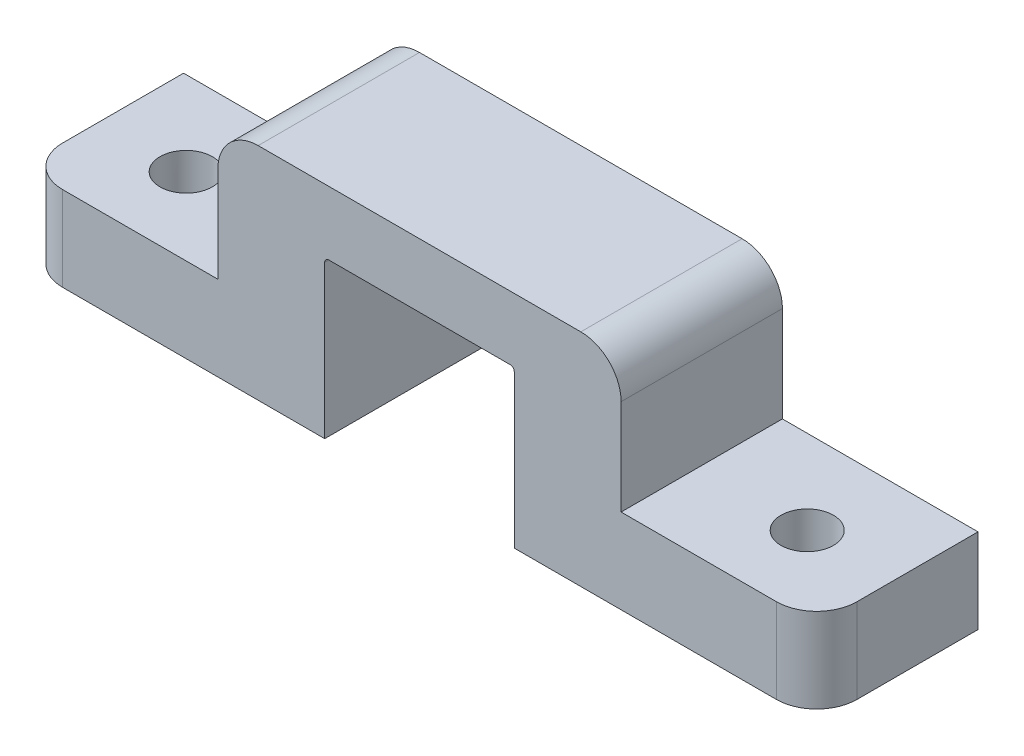
ISO-10303-21;
HEADER;
FILE_DESCRIPTION(('STEP AP214'),'2;1');
FILE_NAME('part.step','',(''),(''),'','','');
FILE_SCHEMA(('AUTOMOTIVE_DESIGN { 1 0 10303 214 1 1 1 1 }'));
ENDSEC;
DATA;
#1=APPLICATION_CONTEXT('core data for automotive mechanical design processes');
#2=APPLICATION_PROTOCOL_DEFINITION('international standard','automotive_design',2000,#1);
#3=PRODUCT_CONTEXT('',#1,'mechanical');
#4=PRODUCT('Part','Part','',(#3));
#5=PRODUCT_RELATED_PRODUCT_CATEGORY('part','',(#4));
#6=PRODUCT_DEFINITION_FORMATION('','',#4);
#7=PRODUCT_DEFINITION_CONTEXT('part definition',#1,'design');
#8=PRODUCT_DEFINITION('design','',#6,#7);
#9=PRODUCT_DEFINITION_SHAPE('','',#8);
#10=(LENGTH_UNIT() NAMED_UNIT(*) SI_UNIT(.MILLI.,.METRE.));
#11=(NAMED_UNIT(*) PLANE_ANGLE_UNIT() SI_UNIT($,.RADIAN.));
#12=(NAMED_UNIT(*) SI_UNIT($,.STERADIAN.) SOLID_ANGLE_UNIT());
#13=UNCERTAINTY_MEASURE_WITH_UNIT(LENGTH_MEASURE(1.E-05),#10,'distance_accuracy_value','');
#14=(GEOMETRIC_REPRESENTATION_CONTEXT(3) GLOBAL_UNCERTAINTY_ASSIGNED_CONTEXT((#13)) GLOBAL_UNIT_ASSIGNED_CONTEXT((#10,
#11,#12)) REPRESENTATION_CONTEXT('',''));
#15=CARTESIAN_POINT('',(0.,0.,0.));
#16=DIRECTION('',(0.,0.,1.));
#17=DIRECTION('',(1.,0.,0.));
#18=AXIS2_PLACEMENT_3D('',#15,#16,#17);
#19=CARTESIAN_POINT('',(25.019,0.,10.16));
#20=DIRECTION('',(0.,1.,0.));
#21=DIRECTION('',(0.,0.,1.));
#22=AXIS2_PLACEMENT_3D('',#19,#20,#21);
#23=PLANE('',#22);
#24=CARTESIAN_POINT('',(19.558,0.,5.29621979529793));
#25=DIRECTION('',(0.,1.,0.));
#26=DIRECTION('',(0.,0.,-1.));
#27=AXIS2_PLACEMENT_3D('',#24,#25,#26);
#28=CIRCLE('',#27,1.651);
#29=CARTESIAN_POINT('',(19.558,0.,3.64521979529793));
#30=VERTEX_POINT('',#29);
#31=EDGE_CURVE('E555',#30,#30,#28,.T.);
#32=ORIENTED_EDGE('',*,*,#31,.T.);
#33=EDGE_LOOP('',(#32));
#34=FACE_BOUND('',#33,.T.);
#35=DIRECTION('',(0.,0.,-1.));
#36=VECTOR('',#35,1.);
#37=CARTESIAN_POINT('',(25.019,0.,10.16));
#38=LINE('',#37,#36);
#39=CARTESIAN_POINT('',(25.019,0.,7.62));
#40=VERTEX_POINT('',#39);
#41=CARTESIAN_POINT('',(25.019,0.,0.));
#42=VERTEX_POINT('',#41);
#43=EDGE_CURVE('E246',#40,#42,#38,.T.);
#44=ORIENTED_EDGE('',*,*,#43,.F.);
#45=CARTESIAN_POINT('',(22.479,0.,7.62));
#46=DIRECTION('',(0.,1.,0.));
#47=DIRECTION('',(0.,0.,1.));
#48=AXIS2_PLACEMENT_3D('',#45,#46,#47);
#49=CIRCLE('',#48,2.54);
#50=CARTESIAN_POINT('',(22.479,0.,10.16));
#51=VERTEX_POINT('',#50);
#52=EDGE_CURVE('E260',#40,#51,#49,.F.);
#53=ORIENTED_EDGE('',*,*,#52,.T.);
#54=DIRECTION('',(1.,0.,0.));
#55=VECTOR('',#54,1.);
#56=CARTESIAN_POINT('',(25.019,0.,10.16));
#57=LINE('',#56,#55);
#58=CARTESIAN_POINT('',(5.969,0.,10.16));
#59=VERTEX_POINT('',#58);
#60=EDGE_CURVE('E166',#59,#51,#57,.T.);
#61=ORIENTED_EDGE('',*,*,#60,.F.);
#62=DIRECTION('',(0.,0.,-1.));
#63=VECTOR('',#62,1.);
#64=CARTESIAN_POINT('',(5.969,0.,10.16));
#65=LINE('',#64,#63);
#66=CARTESIAN_POINT('',(5.969,0.,0.));
#67=VERTEX_POINT('',#66);
#68=EDGE_CURVE('E202',#59,#67,#65,.T.);
#69=ORIENTED_EDGE('',*,*,#68,.T.);
#70=DIRECTION('',(1.,0.,0.));
#71=VECTOR('',#70,1.);
#72=CARTESIAN_POINT('',(25.019,0.,0.));
#73=LINE('',#72,#71);
#74=EDGE_CURVE('E203',#67,#42,#73,.T.);
#75=ORIENTED_EDGE('',*,*,#74,.T.);
#76=EDGE_LOOP('',(#44,#53,#61,#69,#75));
#77=FACE_BOUND('',#76,.T.);
#78=ADVANCED_FACE('F32',(#34,#77),#23,.F.);
#79=CARTESIAN_POINT('',(25.019,5.334,10.16));
#80=DIRECTION('',(-1.,0.,0.));
#81=DIRECTION('',(0.,0.,1.));
#82=AXIS2_PLACEMENT_3D('',#79,#80,#81);
#83=PLANE('',#82);
#84=DIRECTION('',(0.,0.,-1.));
#85=VECTOR('',#84,1.);
#86=CARTESIAN_POINT('',(25.019,5.334,10.16));
#87=LINE('',#86,#85);
#88=CARTESIAN_POINT('',(25.019,5.334,7.62));
#89=VERTEX_POINT('',#88);
#90=CARTESIAN_POINT('',(25.019,5.334,0.));
#91=VERTEX_POINT('',#90);
#92=EDGE_CURVE('E176',#89,#91,#87,.T.);
#93=ORIENTED_EDGE('',*,*,#92,.F.);
#94=DIRECTION('',(0.,1.,0.));
#95=VECTOR('',#94,1.);
#96=CARTESIAN_POINT('',(25.019,5.334,7.62));
#97=LINE('',#96,#95);
#98=EDGE_CURVE('E258',#89,#40,#97,.F.);
#99=ORIENTED_EDGE('',*,*,#98,.T.);
#100=ORIENTED_EDGE('',*,*,#43,.T.);
#101=DIRECTION('',(0.,1.,0.));
#102=VECTOR('',#101,1.);
#103=CARTESIAN_POINT('',(25.019,5.334,0.));
#104=LINE('',#103,#102);
#105=EDGE_CURVE('E206',#42,#91,#104,.T.);
#106=ORIENTED_EDGE('',*,*,#105,.T.);
#107=EDGE_LOOP('',(#93,#99,#100,#106));
#108=FACE_BOUND('',#107,.T.);
#109=ADVANCED_FACE('F317',(#108),#83,.F.);
#110=CARTESIAN_POINT('',(12.7,5.334,10.16));
#111=DIRECTION('',(0.,-1.,0.));
#112=DIRECTION('',(1.,0.,0.));
#113=AXIS2_PLACEMENT_3D('',#110,#111,#112);
#114=PLANE('',#113);
#115=CARTESIAN_POINT('',(19.558,5.334,5.29621979529793));
#116=DIRECTION('',(0.,-1.,0.));
#117=DIRECTION('',(1.,0.,0.));
#118=AXIS2_PLACEMENT_3D('',#115,#116,#117);
#119=CIRCLE('',#118,1.651);
#120=CARTESIAN_POINT('',(21.209,5.334,5.29621979529793));
#121=VERTEX_POINT('',#120);
#122=EDGE_CURVE('E207',#121,#121,#119,.F.);
#123=ORIENTED_EDGE('',*,*,#122,.F.);
#124=EDGE_LOOP('',(#123));
#125=FACE_BOUND('',#124,.T.);
#126=DIRECTION('',(-1.,0.,0.));
#127=VECTOR('',#126,1.);
#128=CARTESIAN_POINT('',(12.7,5.334,10.16));
#129=LINE('',#128,#127);
#130=CARTESIAN_POINT('',(22.479,5.334,10.16));
#131=VERTEX_POINT('',#130);
#132=CARTESIAN_POINT('',(12.7,5.334,10.16));
#133=VERTEX_POINT('',#132);
#134=EDGE_CURVE('E156',#131,#133,#129,.T.);
#135=ORIENTED_EDGE('',*,*,#134,.F.);
#136=CARTESIAN_POINT('',(22.479,5.334,7.62));
#137=DIRECTION('',(0.,-1.,0.));
#138=DIRECTION('',(1.,0.,0.));
#139=AXIS2_PLACEMENT_3D('',#136,#137,#138);
#140=CIRCLE('',#139,2.54);
#141=EDGE_CURVE('E256',#131,#89,#140,.F.);
#142=ORIENTED_EDGE('',*,*,#141,.T.);
#143=ORIENTED_EDGE('',*,*,#92,.T.);
#144=DIRECTION('',(-1.,0.,0.));
#145=VECTOR('',#144,1.);
#146=CARTESIAN_POINT('',(12.7,5.334,0.));
#147=LINE('',#146,#145);
#148=CARTESIAN_POINT('',(12.7,5.334,0.));
#149=VERTEX_POINT('',#148);
#150=EDGE_CURVE('E172',#91,#149,#147,.T.);
#151=ORIENTED_EDGE('',*,*,#150,.T.);
#152=DIRECTION('',(0.,0.,-1.));
#153=VECTOR('',#152,1.);
#154=CARTESIAN_POINT('',(12.7,5.334,10.16));
#155=LINE('',#154,#153);
#156=EDGE_CURVE('E169',#133,#149,#155,.T.);
#157=ORIENTED_EDGE('',*,*,#156,.F.);
#158=EDGE_LOOP('',(#135,#142,#143,#151,#157));
#159=FACE_BOUND('',#158,.T.);
#160=ADVANCED_FACE('F170',(#125,#159),#114,.F.);
#161=CARTESIAN_POINT('',(12.7,13.8940170940171,10.16));
#162=DIRECTION('',(-1.,0.,0.));
#163=DIRECTION('',(0.,-1.,0.));
#164=AXIS2_PLACEMENT_3D('',#161,#162,#163);
#165=PLANE('',#164);
#166=DIRECTION('',(0.,1.,0.));
#167=VECTOR('',#166,1.);
#168=CARTESIAN_POINT('',(12.7,13.8940170940171,0.));
#169=LINE('',#168,#167);
#170=CARTESIAN_POINT('',(12.7,11.3540170940171,0.));
#171=VERTEX_POINT('',#170);
#172=EDGE_CURVE('E211',#149,#171,#169,.T.);
#173=ORIENTED_EDGE('',*,*,#172,.T.);
#174=DIRECTION('',(0.,0.,-1.));
#175=VECTOR('',#174,1.);
#176=CARTESIAN_POINT('',(12.7,11.3540170940171,10.16));
#177=LINE('',#176,#175);
#178=CARTESIAN_POINT('',(12.7,11.3540170940171,10.16));
#179=VERTEX_POINT('',#178);
#180=EDGE_CURVE('E181',#171,#179,#177,.F.);
#181=ORIENTED_EDGE('',*,*,#180,.T.);
#182=DIRECTION('',(0.,1.,0.));
#183=VECTOR('',#182,1.);
#184=CARTESIAN_POINT('',(12.7,13.8940170940171,10.16));
#185=LINE('',#184,#183);
#186=EDGE_CURVE('E161',#133,#179,#185,.T.);
#187=ORIENTED_EDGE('',*,*,#186,.F.);
#188=ORIENTED_EDGE('',*,*,#156,.T.);
#189=EDGE_LOOP('',(#173,#181,#187,#188));
#190=FACE_BOUND('',#189,.T.);
#191=ADVANCED_FACE('F179',(#190),#165,.F.);
#192=CARTESIAN_POINT('',(12.7,13.8940170940171,10.16));
#193=DIRECTION('',(0.,-1.,0.));
#194=DIRECTION('',(0.,0.,-1.));
#195=AXIS2_PLACEMENT_3D('',#192,#193,#194);
#196=PLANE('',#195);
#197=DIRECTION('',(-1.,0.,0.));
#198=VECTOR('',#197,1.);
#199=CARTESIAN_POINT('',(12.7,13.8940170940171,0.));
#200=LINE('',#199,#198);
#201=CARTESIAN_POINT('',(10.16,13.8940170940171,0.));
#202=VERTEX_POINT('',#201);
#203=CARTESIAN_POINT('',(-10.16,13.8940170940171,0.));
#204=VERTEX_POINT('',#203);
#205=EDGE_CURVE('E213',#202,#204,#200,.T.);
#206=ORIENTED_EDGE('',*,*,#205,.T.);
#207=DIRECTION('',(0.,0.,-1.));
#208=VECTOR('',#207,1.);
#209=CARTESIAN_POINT('',(-10.16,13.8940170940171,10.16));
#210=LINE('',#209,#208);
#211=CARTESIAN_POINT('',(-10.16,13.8940170940171,10.16));
#212=VERTEX_POINT('',#211);
#213=EDGE_CURVE('E278',#204,#212,#210,.F.);
#214=ORIENTED_EDGE('',*,*,#213,.T.);
#215=DIRECTION('',(-1.,0.,0.));
#216=VECTOR('',#215,1.);
#217=CARTESIAN_POINT('',(12.7,13.8940170940171,10.16));
#218=LINE('',#217,#216);
#219=CARTESIAN_POINT('',(10.16,13.8940170940171,10.16));
#220=VERTEX_POINT('',#219);
#221=EDGE_CURVE('E182',#220,#212,#218,.T.);
#222=ORIENTED_EDGE('',*,*,#221,.F.);
#223=DIRECTION('',(0.,0.,-1.));
#224=VECTOR('',#223,1.);
#225=CARTESIAN_POINT('',(10.16,13.8940170940171,10.16));
#226=LINE('',#225,#224);
#227=EDGE_CURVE('E275',#220,#202,#226,.T.);
#228=ORIENTED_EDGE('',*,*,#227,.T.);
#229=EDGE_LOOP('',(#206,#214,#222,#228));
#230=FACE_BOUND('',#229,.T.);
#231=ADVANCED_FACE('F327',(#230),#196,.F.);
#232=CARTESIAN_POINT('',(-12.7,13.8940170940171,10.16));
#233=DIRECTION('',(1.,0.,0.));
#234=DIRECTION('',(0.,1.,0.));
#235=AXIS2_PLACEMENT_3D('',#232,#233,#234);
#236=PLANE('',#235);
#237=DIRECTION('',(0.,-1.,0.));
#238=VECTOR('',#237,1.);
#239=CARTESIAN_POINT('',(-12.7,13.8940170940171,10.16));
#240=LINE('',#239,#238);
#241=CARTESIAN_POINT('',(-12.7,11.3540170940171,10.16));
#242=VERTEX_POINT('',#241);
#243=CARTESIAN_POINT('',(-12.7,5.334,10.16));
#244=VERTEX_POINT('',#243);
#245=EDGE_CURVE('E185',#242,#244,#240,.T.);
#246=ORIENTED_EDGE('',*,*,#245,.F.);
#247=DIRECTION('',(0.,0.,-1.));
#248=VECTOR('',#247,1.);
#249=CARTESIAN_POINT('',(-12.7,11.3540170940171,10.16));
#250=LINE('',#249,#248);
#251=CARTESIAN_POINT('',(-12.7,11.3540170940171,0.));
#252=VERTEX_POINT('',#251);
#253=EDGE_CURVE('E268',#242,#252,#250,.T.);
#254=ORIENTED_EDGE('',*,*,#253,.T.);
#255=DIRECTION('',(0.,-1.,0.));
#256=VECTOR('',#255,1.);
#257=CARTESIAN_POINT('',(-12.7,13.8940170940171,0.));
#258=LINE('',#257,#256);
#259=CARTESIAN_POINT('',(-12.7,5.334,0.));
#260=VERTEX_POINT('',#259);
#261=EDGE_CURVE('E216',#252,#260,#258,.T.);
#262=ORIENTED_EDGE('',*,*,#261,.T.);
#263=DIRECTION('',(0.,0.,-1.));
#264=VECTOR('',#263,1.);
#265=CARTESIAN_POINT('',(-12.7,5.334,10.16));
#266=LINE('',#265,#264);
#267=EDGE_CURVE('E177',#244,#260,#266,.T.);
#268=ORIENTED_EDGE('',*,*,#267,.F.);
#269=EDGE_LOOP('',(#246,#254,#262,#268));
#270=FACE_BOUND('',#269,.T.);
#271=ADVANCED_FACE('F335',(#270),#236,.F.);
#272=CARTESIAN_POINT('',(-12.7,5.334,10.16));
#273=DIRECTION('',(0.,-1.,0.));
#274=DIRECTION('',(1.,0.,0.));
#275=AXIS2_PLACEMENT_3D('',#272,#273,#274);
#276=PLANE('',#275);
#277=CARTESIAN_POINT('',(-19.558,5.334,5.29621979529793));
#278=DIRECTION('',(0.,-1.,0.));
#279=DIRECTION('',(1.,0.,0.));
#280=AXIS2_PLACEMENT_3D('',#277,#278,#279);
#281=CIRCLE('',#280,1.651);
#282=CARTESIAN_POINT('',(-17.907,5.334,5.29621979529793));
#283=VERTEX_POINT('',#282);
#284=EDGE_CURVE('E284',#283,#283,#281,.F.);
#285=ORIENTED_EDGE('',*,*,#284,.F.);
#286=EDGE_LOOP('',(#285));
#287=FACE_BOUND('',#286,.T.);
#288=DIRECTION('',(0.,0.,-1.));
#289=VECTOR('',#288,1.);
#290=CARTESIAN_POINT('',(-25.019,5.334,10.16));
#291=LINE('',#290,#289);
#292=CARTESIAN_POINT('',(-25.019,5.334,7.62));
#293=VERTEX_POINT('',#292);
#294=CARTESIAN_POINT('',(-25.019,5.334,0.));
#295=VERTEX_POINT('',#294);
#296=EDGE_CURVE('E241',#293,#295,#291,.T.);
#297=ORIENTED_EDGE('',*,*,#296,.F.);
#298=CARTESIAN_POINT('',(-22.479,5.334,7.62));
#299=DIRECTION('',(0.,-1.,0.));
#300=DIRECTION('',(1.,0.,0.));
#301=AXIS2_PLACEMENT_3D('',#298,#299,#300);
#302=CIRCLE('',#301,2.54);
#303=CARTESIAN_POINT('',(-22.479,5.334,10.16));
#304=VERTEX_POINT('',#303);
#305=EDGE_CURVE('E266',#293,#304,#302,.F.);
#306=ORIENTED_EDGE('',*,*,#305,.T.);
#307=DIRECTION('',(-1.,0.,0.));
#308=VECTOR('',#307,1.);
#309=CARTESIAN_POINT('',(-12.7,5.334,10.16));
#310=LINE('',#309,#308);
#311=EDGE_CURVE('E190',#244,#304,#310,.T.);
#312=ORIENTED_EDGE('',*,*,#311,.F.);
#313=ORIENTED_EDGE('',*,*,#267,.T.);
#314=DIRECTION('',(-1.,0.,0.));
#315=VECTOR('',#314,1.);
#316=CARTESIAN_POINT('',(-12.7,5.334,0.));
#317=LINE('',#316,#315);
#318=EDGE_CURVE('E218',#260,#295,#317,.T.);
#319=ORIENTED_EDGE('',*,*,#318,.T.);
#320=EDGE_LOOP('',(#297,#306,#312,#313,#319));
#321=FACE_BOUND('',#320,.T.);
#322=ADVANCED_FACE('F340',(#287,#321),#276,.F.);
#323=CARTESIAN_POINT('',(-25.019,5.334,10.16));
#324=DIRECTION('',(1.,0.,0.));
#325=DIRECTION('',(0.,0.,-1.));
#326=AXIS2_PLACEMENT_3D('',#323,#324,#325);
#327=PLANE('',#326);
#328=DIRECTION('',(0.,0.,-1.));
#329=VECTOR('',#328,1.);
#330=CARTESIAN_POINT('',(-25.019,0.,10.16));
#331=LINE('',#330,#329);
#332=CARTESIAN_POINT('',(-25.019,0.,7.62));
#333=VERTEX_POINT('',#332);
#334=CARTESIAN_POINT('',(-25.019,0.,0.));
#335=VERTEX_POINT('',#334);
#336=EDGE_CURVE('E239',#333,#335,#331,.T.);
#337=ORIENTED_EDGE('',*,*,#336,.F.);
#338=DIRECTION('',(0.,-1.,0.));
#339=VECTOR('',#338,1.);
#340=CARTESIAN_POINT('',(-25.019,5.334,7.62));
#341=LINE('',#340,#339);
#342=EDGE_CURVE('E264',#333,#293,#341,.F.);
#343=ORIENTED_EDGE('',*,*,#342,.T.);
#344=ORIENTED_EDGE('',*,*,#296,.T.);
#345=DIRECTION('',(0.,-1.,0.));
#346=VECTOR('',#345,1.);
#347=CARTESIAN_POINT('',(-25.019,5.334,0.));
#348=LINE('',#347,#346);
#349=EDGE_CURVE('E221',#295,#335,#348,.T.);
#350=ORIENTED_EDGE('',*,*,#349,.T.);
#351=EDGE_LOOP('',(#337,#343,#344,#350));
#352=FACE_BOUND('',#351,.T.);
#353=ADVANCED_FACE('F352',(#352),#327,.F.);
#354=CARTESIAN_POINT('',(-25.019,0.,10.16));
#355=DIRECTION('',(0.,1.,0.));
#356=DIRECTION('',(0.,0.,1.));
#357=AXIS2_PLACEMENT_3D('',#354,#355,#356);
#358=PLANE('',#357);
#359=CARTESIAN_POINT('',(-19.558,0.,5.29621979529793));
#360=DIRECTION('',(0.,1.,0.));
#361=DIRECTION('',(0.,0.,1.));
#362=AXIS2_PLACEMENT_3D('',#359,#360,#361);
#363=CIRCLE('',#362,1.651);
#364=CARTESIAN_POINT('',(-19.558,0.,6.94721979529793));
#365=VERTEX_POINT('',#364);
#366=EDGE_CURVE('E552',#365,#365,#363,.T.);
#367=ORIENTED_EDGE('',*,*,#366,.T.);
#368=EDGE_LOOP('',(#367));
#369=FACE_BOUND('',#368,.T.);
#370=DIRECTION('',(1.,0.,0.));
#371=VECTOR('',#370,1.);
#372=CARTESIAN_POINT('',(-25.019,0.,10.16));
#373=LINE('',#372,#371);
#374=CARTESIAN_POINT('',(-22.479,0.,10.16));
#375=VERTEX_POINT('',#374);
#376=CARTESIAN_POINT('',(-5.969,0.,10.16));
#377=VERTEX_POINT('',#376);
#378=EDGE_CURVE('E193',#375,#377,#373,.T.);
#379=ORIENTED_EDGE('',*,*,#378,.F.);
#380=CARTESIAN_POINT('',(-22.479,0.,7.62));
#381=DIRECTION('',(0.,1.,0.));
#382=DIRECTION('',(0.,0.,1.));
#383=AXIS2_PLACEMENT_3D('',#380,#381,#382);
#384=CIRCLE('',#383,2.54);
#385=EDGE_CURVE('E262',#375,#333,#384,.F.);
#386=ORIENTED_EDGE('',*,*,#385,.T.);
#387=ORIENTED_EDGE('',*,*,#336,.T.);
#388=DIRECTION('',(1.,0.,0.));
#389=VECTOR('',#388,1.);
#390=CARTESIAN_POINT('',(-25.019,0.,0.));
#391=LINE('',#390,#389);
#392=CARTESIAN_POINT('',(-5.969,0.,0.));
#393=VERTEX_POINT('',#392);
#394=EDGE_CURVE('E224',#335,#393,#391,.T.);
#395=ORIENTED_EDGE('',*,*,#394,.T.);
#396=DIRECTION('',(0.,0.,-1.));
#397=VECTOR('',#396,1.);
#398=CARTESIAN_POINT('',(-5.969,0.,10.16));
#399=LINE('',#398,#397);
#400=EDGE_CURVE('E236',#377,#393,#399,.T.);
#401=ORIENTED_EDGE('',*,*,#400,.F.);
#402=EDGE_LOOP('',(#379,#386,#387,#395,#401));
#403=FACE_BOUND('',#402,.T.);
#404=ADVANCED_FACE('F349',(#369,#403),#358,.F.);
#405=CARTESIAN_POINT('',(-5.969,0.,10.16));
#406=DIRECTION('',(-1.,0.,0.));
#407=DIRECTION('',(0.,0.,1.));
#408=AXIS2_PLACEMENT_3D('',#405,#406,#407);
#409=PLANE('',#408);
#410=DIRECTION('',(0.,1.,0.));
#411=VECTOR('',#410,1.);
#412=CARTESIAN_POINT('',(-5.969,0.,0.));
#413=LINE('',#412,#411);
#414=CARTESIAN_POINT('',(-5.969,9.62377777777776,0.));
#415=VERTEX_POINT('',#414);
#416=EDGE_CURVE('E226',#393,#415,#413,.T.);
#417=ORIENTED_EDGE('',*,*,#416,.T.);
#418=DIRECTION('',(0.,0.,-1.));
#419=VECTOR('',#418,1.);
#420=CARTESIAN_POINT('',(-5.969,9.62377777777776,10.16));
#421=LINE('',#420,#419);
#422=CARTESIAN_POINT('',(-5.969,9.62377777777776,10.16));
#423=VERTEX_POINT('',#422);
#424=EDGE_CURVE('E289',#415,#423,#421,.F.);
#425=ORIENTED_EDGE('',*,*,#424,.T.);
#426=DIRECTION('',(0.,1.,0.));
#427=VECTOR('',#426,1.);
#428=CARTESIAN_POINT('',(-5.969,0.,10.16));
#429=LINE('',#428,#427);
#430=EDGE_CURVE('E195',#377,#423,#429,.T.);
#431=ORIENTED_EDGE('',*,*,#430,.F.);
#432=ORIENTED_EDGE('',*,*,#400,.T.);
#433=EDGE_LOOP('',(#417,#425,#431,#432));
#434=FACE_BOUND('',#433,.T.);
#435=ADVANCED_FACE('F358',(#434),#409,.F.);
#436=CARTESIAN_POINT('',(-5.969,9.87777777777776,10.16));
#437=DIRECTION('',(0.,1.,0.));
#438=DIRECTION('',(0.,0.,1.));
#439=AXIS2_PLACEMENT_3D('',#436,#437,#438);
#440=PLANE('',#439);
#441=DIRECTION('',(1.,0.,0.));
#442=VECTOR('',#441,1.);
#443=CARTESIAN_POINT('',(-5.969,9.87777777777776,10.16));
#444=LINE('',#443,#442);
#445=CARTESIAN_POINT('',(-5.715,9.87777777777776,10.16));
#446=VERTEX_POINT('',#445);
#447=CARTESIAN_POINT('',(5.715,9.87777777777776,10.16));
#448=VERTEX_POINT('',#447);
#449=EDGE_CURVE('E198',#446,#448,#444,.T.);
#450=ORIENTED_EDGE('',*,*,#449,.F.);
#451=DIRECTION('',(0.,0.,-1.));
#452=VECTOR('',#451,1.);
#453=CARTESIAN_POINT('',(-5.715,9.87777777777776,0.));
#454=LINE('',#453,#452);
#455=CARTESIAN_POINT('',(-5.715,9.87777777777776,0.));
#456=VERTEX_POINT('',#455);
#457=EDGE_CURVE('E286',#446,#456,#454,.T.);
#458=ORIENTED_EDGE('',*,*,#457,.T.);
#459=DIRECTION('',(1.,0.,0.));
#460=VECTOR('',#459,1.);
#461=CARTESIAN_POINT('',(-5.969,9.87777777777776,0.));
#462=LINE('',#461,#460);
#463=CARTESIAN_POINT('',(5.715,9.87777777777776,0.));
#464=VERTEX_POINT('',#463);
#465=EDGE_CURVE('E229',#456,#464,#462,.T.);
#466=ORIENTED_EDGE('',*,*,#465,.T.);
#467=DIRECTION('',(0.,0.,-1.));
#468=VECTOR('',#467,1.);
#469=CARTESIAN_POINT('',(5.715,9.87777777777776,10.16));
#470=LINE('',#469,#468);
#471=EDGE_CURVE('E281',#464,#448,#470,.F.);
#472=ORIENTED_EDGE('',*,*,#471,.T.);
#473=EDGE_LOOP('',(#450,#458,#466,#472));
#474=FACE_BOUND('',#473,.T.);
#475=ADVANCED_FACE('F304',(#474),#440,.F.);
#476=CARTESIAN_POINT('',(5.969,0.,10.16));
#477=DIRECTION('',(1.,0.,0.));
#478=DIRECTION('',(0.,0.,-1.));
#479=AXIS2_PLACEMENT_3D('',#476,#477,#478);
#480=PLANE('',#479);
#481=DIRECTION('',(0.,-1.,0.));
#482=VECTOR('',#481,1.);
#483=CARTESIAN_POINT('',(5.969,0.,10.16));
#484=LINE('',#483,#482);
#485=CARTESIAN_POINT('',(5.969,9.62377777777776,10.16));
#486=VERTEX_POINT('',#485);
#487=EDGE_CURVE('E200',#486,#59,#484,.T.);
#488=ORIENTED_EDGE('',*,*,#487,.F.);
#489=DIRECTION('',(0.,0.,-1.));
#490=VECTOR('',#489,1.);
#491=CARTESIAN_POINT('',(5.969,9.62377777777776,0.));
#492=LINE('',#491,#490);
#493=CARTESIAN_POINT('',(5.969,9.62377777777776,0.));
#494=VERTEX_POINT('',#493);
#495=EDGE_CURVE('E291',#486,#494,#492,.T.);
#496=ORIENTED_EDGE('',*,*,#495,.T.);
#497=DIRECTION('',(0.,-1.,0.));
#498=VECTOR('',#497,1.);
#499=CARTESIAN_POINT('',(5.969,0.,0.));
#500=LINE('',#499,#498);
#501=EDGE_CURVE('E232',#494,#67,#500,.T.);
#502=ORIENTED_EDGE('',*,*,#501,.T.);
#503=ORIENTED_EDGE('',*,*,#68,.F.);
#504=EDGE_LOOP('',(#488,#496,#502,#503));
#505=FACE_BOUND('',#504,.T.);
#506=ADVANCED_FACE('F307',(#505),#480,.F.);
#507=CARTESIAN_POINT('',(0.,0.,10.16));
#508=DIRECTION('',(0.,0.,-1.));
#509=DIRECTION('',(-1.,0.,0.));
#510=AXIS2_PLACEMENT_3D('',#507,#508,#509);
#511=PLANE('',#510);
#512=ORIENTED_EDGE('',*,*,#60,.T.);
#513=DIRECTION('',(0.,1.,0.));
#514=VECTOR('',#513,1.);
#515=CARTESIAN_POINT('',(22.479,0.,10.16));
#516=LINE('',#515,#514);
#517=EDGE_CURVE('E164',#51,#131,#516,.T.);
#518=ORIENTED_EDGE('',*,*,#517,.T.);
#519=ORIENTED_EDGE('',*,*,#134,.T.);
#520=ORIENTED_EDGE('',*,*,#186,.T.);
#521=CARTESIAN_POINT('',(10.16,11.3540170940171,10.16));
#522=DIRECTION('',(0.,0.,-1.));
#523=DIRECTION('',(-1.,0.,0.));
#524=AXIS2_PLACEMENT_3D('',#521,#522,#523);
#525=CIRCLE('',#524,2.54);
#526=EDGE_CURVE('E248',#179,#220,#525,.F.);
#527=ORIENTED_EDGE('',*,*,#526,.T.);
#528=ORIENTED_EDGE('',*,*,#221,.T.);
#529=CARTESIAN_POINT('',(-10.16,11.3540170940171,10.16));
#530=DIRECTION('',(0.,0.,-1.));
#531=DIRECTION('',(-1.,0.,0.));
#532=AXIS2_PLACEMENT_3D('',#529,#530,#531);
#533=CIRCLE('',#532,2.54);
#534=EDGE_CURVE('E250',#212,#242,#533,.F.);
#535=ORIENTED_EDGE('',*,*,#534,.T.);
#536=ORIENTED_EDGE('',*,*,#245,.T.);
#537=ORIENTED_EDGE('',*,*,#311,.T.);
#538=DIRECTION('',(0.,-1.,0.));
#539=VECTOR('',#538,1.);
#540=CARTESIAN_POINT('',(-22.479,0.,10.16));
#541=LINE('',#540,#539);
#542=EDGE_CURVE('E252',#304,#375,#541,.T.);
#543=ORIENTED_EDGE('',*,*,#542,.T.);
#544=ORIENTED_EDGE('',*,*,#378,.T.);
#545=ORIENTED_EDGE('',*,*,#430,.T.);
#546=CARTESIAN_POINT('',(-5.715,9.62377777777776,10.16));
#547=DIRECTION('',(0.,0.,-1.));
#548=DIRECTION('',(-1.,0.,0.));
#549=AXIS2_PLACEMENT_3D('',#546,#547,#548);
#550=CIRCLE('',#549,0.254);
#551=EDGE_CURVE('E295',#423,#446,#550,.T.);
#552=ORIENTED_EDGE('',*,*,#551,.T.);
#553=ORIENTED_EDGE('',*,*,#449,.T.);
#554=CARTESIAN_POINT('',(5.715,9.62377777777776,10.16));
#555=DIRECTION('',(0.,0.,-1.));
#556=DIRECTION('',(-1.,0.,0.));
#557=AXIS2_PLACEMENT_3D('',#554,#555,#556);
#558=CIRCLE('',#557,0.254);
#559=EDGE_CURVE('E11',#448,#486,#558,.T.);
#560=ORIENTED_EDGE('',*,*,#559,.T.);
#561=ORIENTED_EDGE('',*,*,#487,.T.);
#562=EDGE_LOOP('',(#512,#518,#519,#520,#527,#528,#535,#536,#537,#543,#544,#545,#552,#553,#560,#561));
#563=FACE_BOUND('',#562,.T.);
#564=ADVANCED_FACE('F159',(#563),#511,.F.);
#565=CARTESIAN_POINT('',(0.,0.,0.));
#566=DIRECTION('',(0.,0.,-1.));
#567=DIRECTION('',(-1.,0.,0.));
#568=AXIS2_PLACEMENT_3D('',#565,#566,#567);
#569=PLANE('',#568);
#570=ORIENTED_EDGE('',*,*,#261,.F.);
#571=CARTESIAN_POINT('',(-10.16,11.3540170940171,0.));
#572=DIRECTION('',(0.,0.,-1.));
#573=DIRECTION('',(-1.,0.,0.));
#574=AXIS2_PLACEMENT_3D('',#571,#572,#573);
#575=CIRCLE('',#574,2.54);
#576=EDGE_CURVE('E273',#252,#204,#575,.T.);
#577=ORIENTED_EDGE('',*,*,#576,.T.);
#578=ORIENTED_EDGE('',*,*,#205,.F.);
#579=CARTESIAN_POINT('',(10.16,11.3540170940171,0.));
#580=DIRECTION('',(0.,0.,-1.));
#581=DIRECTION('',(-1.,0.,0.));
#582=AXIS2_PLACEMENT_3D('',#579,#580,#581);
#583=CIRCLE('',#582,2.54);
#584=EDGE_CURVE('E271',#202,#171,#583,.T.);
#585=ORIENTED_EDGE('',*,*,#584,.T.);
#586=ORIENTED_EDGE('',*,*,#172,.F.);
#587=ORIENTED_EDGE('',*,*,#150,.F.);
#588=ORIENTED_EDGE('',*,*,#105,.F.);
#589=ORIENTED_EDGE('',*,*,#74,.F.);
#590=ORIENTED_EDGE('',*,*,#501,.F.);
#591=CARTESIAN_POINT('',(5.715,9.62377777777776,0.));
#592=DIRECTION('',(0.,0.,-1.));
#593=DIRECTION('',(-1.,0.,0.));
#594=AXIS2_PLACEMENT_3D('',#591,#592,#593);
#595=CIRCLE('',#594,0.254);
#596=EDGE_CURVE('E40',#494,#464,#595,.F.);
#597=ORIENTED_EDGE('',*,*,#596,.T.);
#598=ORIENTED_EDGE('',*,*,#465,.F.);
#599=CARTESIAN_POINT('',(-5.715,9.62377777777776,0.));
#600=DIRECTION('',(0.,0.,-1.));
#601=DIRECTION('',(-1.,0.,0.));
#602=AXIS2_PLACEMENT_3D('',#599,#600,#601);
#603=CIRCLE('',#602,0.254);
#604=EDGE_CURVE('E293',#456,#415,#603,.F.);
#605=ORIENTED_EDGE('',*,*,#604,.T.);
#606=ORIENTED_EDGE('',*,*,#416,.F.);
#607=ORIENTED_EDGE('',*,*,#394,.F.);
#608=ORIENTED_EDGE('',*,*,#349,.F.);
#609=ORIENTED_EDGE('',*,*,#318,.F.);
#610=EDGE_LOOP('',(#570,#577,#578,#585,#586,#587,#588,#589,#590,#597,#598,#605,#606,#607,#608,#609));
#611=FACE_BOUND('',#610,.T.);
#612=ADVANCED_FACE('F300',(#611),#569,.T.);
#613=CARTESIAN_POINT('',(22.479,0.,7.62));
#614=DIRECTION('',(0.,1.,0.));
#615=DIRECTION('',(0.,0.,1.));
#616=AXIS2_PLACEMENT_3D('',#613,#614,#615);
#617=CYLINDRICAL_SURFACE('',#616,2.54);
#618=ORIENTED_EDGE('',*,*,#52,.F.);
#619=ORIENTED_EDGE('',*,*,#98,.F.);
#620=ORIENTED_EDGE('',*,*,#141,.F.);
#621=ORIENTED_EDGE('',*,*,#517,.F.);
#622=EDGE_LOOP('',(#618,#619,#620,#621));
#623=FACE_BOUND('',#622,.T.);
#624=ADVANCED_FACE('F313',(#623),#617,.T.);
#625=CARTESIAN_POINT('',(-22.479,0.,7.62));
#626=DIRECTION('',(0.,-1.,0.));
#627=DIRECTION('',(0.,0.,-1.));
#628=AXIS2_PLACEMENT_3D('',#625,#626,#627);
#629=CYLINDRICAL_SURFACE('',#628,2.54);
#630=ORIENTED_EDGE('',*,*,#305,.F.);
#631=ORIENTED_EDGE('',*,*,#342,.F.);
#632=ORIENTED_EDGE('',*,*,#385,.F.);
#633=ORIENTED_EDGE('',*,*,#542,.F.);
#634=EDGE_LOOP('',(#630,#631,#632,#633));
#635=FACE_BOUND('',#634,.T.);
#636=ADVANCED_FACE('F345',(#635),#629,.T.);
#637=CARTESIAN_POINT('',(-10.16,11.3540170940171,10.16));
#638=DIRECTION('',(0.,0.,-1.));
#639=DIRECTION('',(-1.,0.,0.));
#640=AXIS2_PLACEMENT_3D('',#637,#638,#639);
#641=CYLINDRICAL_SURFACE('',#640,2.54);
#642=ORIENTED_EDGE('',*,*,#534,.F.);
#643=ORIENTED_EDGE('',*,*,#213,.F.);
#644=ORIENTED_EDGE('',*,*,#576,.F.);
#645=ORIENTED_EDGE('',*,*,#253,.F.);
#646=EDGE_LOOP('',(#642,#643,#644,#645));
#647=FACE_BOUND('',#646,.T.);
#648=ADVANCED_FACE('F330',(#647),#641,.T.);
#649=CARTESIAN_POINT('',(10.16,11.3540170940171,10.16));
#650=DIRECTION('',(0.,0.,-1.));
#651=DIRECTION('',(-1.,0.,0.));
#652=AXIS2_PLACEMENT_3D('',#649,#650,#651);
#653=CYLINDRICAL_SURFACE('',#652,2.54);
#654=ORIENTED_EDGE('',*,*,#526,.F.);
#655=ORIENTED_EDGE('',*,*,#180,.F.);
#656=ORIENTED_EDGE('',*,*,#584,.F.);
#657=ORIENTED_EDGE('',*,*,#227,.F.);
#658=EDGE_LOOP('',(#654,#655,#656,#657));
#659=FACE_BOUND('',#658,.T.);
#660=ADVANCED_FACE('F322',(#659),#653,.T.);
#661=CARTESIAN_POINT('',(-19.558,10.16,5.29621979529793));
#662=DIRECTION('',(0.,-1.,0.));
#663=DIRECTION('',(0.,0.,-1.));
#664=AXIS2_PLACEMENT_3D('',#661,#662,#663);
#665=CYLINDRICAL_SURFACE('',#664,1.651);
#666=ORIENTED_EDGE('',*,*,#366,.F.);
#667=EDGE_LOOP('',(#666));
#668=FACE_BOUND('',#667,.T.);
#669=ORIENTED_EDGE('',*,*,#284,.T.);
#670=EDGE_LOOP('',(#669));
#671=FACE_BOUND('',#670,.T.);
#672=ADVANCED_FACE('F369',(#668,#671),#665,.F.);
#673=CARTESIAN_POINT('',(19.558,10.16,5.29621979529793));
#674=DIRECTION('',(0.,-1.,0.));
#675=DIRECTION('',(0.,0.,-1.));
#676=AXIS2_PLACEMENT_3D('',#673,#674,#675);
#677=CYLINDRICAL_SURFACE('',#676,1.651);
#678=ORIENTED_EDGE('',*,*,#31,.F.);
#679=EDGE_LOOP('',(#678));
#680=FACE_BOUND('',#679,.T.);
#681=ORIENTED_EDGE('',*,*,#122,.T.);
#682=EDGE_LOOP('',(#681));
#683=FACE_BOUND('',#682,.T.);
#684=ADVANCED_FACE('F364',(#680,#683),#677,.F.);
#685=CARTESIAN_POINT('',(-5.715,9.62377777777776,10.16));
#686=DIRECTION('',(0.,0.,1.));
#687=DIRECTION('',(1.,0.,0.));
#688=AXIS2_PLACEMENT_3D('',#685,#686,#687);
#689=CYLINDRICAL_SURFACE('',#688,0.254);
#690=ORIENTED_EDGE('',*,*,#551,.F.);
#691=ORIENTED_EDGE('',*,*,#424,.F.);
#692=ORIENTED_EDGE('',*,*,#604,.F.);
#693=ORIENTED_EDGE('',*,*,#457,.F.);
#694=EDGE_LOOP('',(#690,#691,#692,#693));
#695=FACE_BOUND('',#694,.T.);
#696=ADVANCED_FACE('F362',(#695),#689,.F.);
#697=CARTESIAN_POINT('',(5.715,9.62377777777776,10.16));
#698=DIRECTION('',(0.,0.,1.));
#699=DIRECTION('',(1.,0.,0.));
#700=AXIS2_PLACEMENT_3D('',#697,#698,#699);
#701=CYLINDRICAL_SURFACE('',#700,0.254);
#702=ORIENTED_EDGE('',*,*,#559,.F.);
#703=ORIENTED_EDGE('',*,*,#471,.F.);
#704=ORIENTED_EDGE('',*,*,#596,.F.);
#705=ORIENTED_EDGE('',*,*,#495,.F.);
#706=EDGE_LOOP('',(#702,#703,#704,#705));
#707=FACE_BOUND('',#706,.T.);
#708=ADVANCED_FACE('F34',(#707),#701,.F.);
#709=CLOSED_SHELL('',(#78,#109,#160,#191,#231,#271,#322,#353,#404,#435,#475,#506,#564,#612,#624,
#636,#648,#660,#672,#684,#696,#708));
#710=MANIFOLD_SOLID_BREP('B2',#709);
#711=ADVANCED_BREP_SHAPE_REPRESENTATION('',(#18,#710),#14);
#712=SHAPE_DEFINITION_REPRESENTATION(#9,#711);
ENDSEC;
END-ISO-10303-21;
